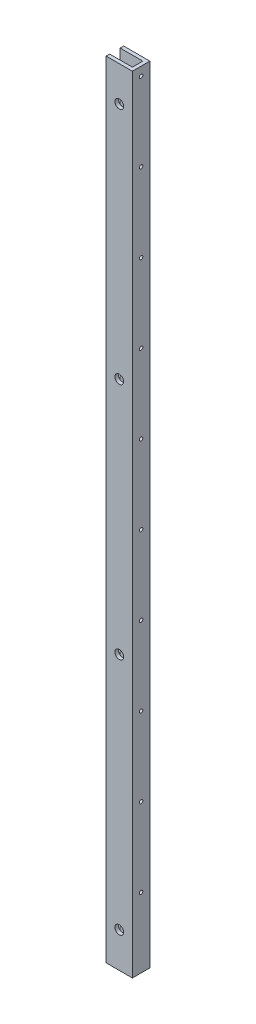
ISO-10303-21;
HEADER;
FILE_DESCRIPTION(('STEP AP214'),'2;1');
FILE_NAME('part.step','',(''),(''),'','','');
FILE_SCHEMA(('AUTOMOTIVE_DESIGN { 1 0 10303 214 1 1 1 1 }'));
ENDSEC;
DATA;
#1=APPLICATION_CONTEXT('core data for automotive mechanical design processes');
#2=APPLICATION_PROTOCOL_DEFINITION('international standard','automotive_design',2000,#1);
#3=PRODUCT_CONTEXT('',#1,'mechanical');
#4=PRODUCT('Part','Part','',(#3));
#5=PRODUCT_RELATED_PRODUCT_CATEGORY('part','',(#4));
#6=PRODUCT_DEFINITION_FORMATION('','',#4);
#7=PRODUCT_DEFINITION_CONTEXT('part definition',#1,'design');
#8=PRODUCT_DEFINITION('design','',#6,#7);
#9=PRODUCT_DEFINITION_SHAPE('','',#8);
#10=(LENGTH_UNIT() NAMED_UNIT(*) SI_UNIT(.MILLI.,.METRE.));
#11=(NAMED_UNIT(*) PLANE_ANGLE_UNIT() SI_UNIT($,.RADIAN.));
#12=(NAMED_UNIT(*) SI_UNIT($,.STERADIAN.) SOLID_ANGLE_UNIT());
#13=UNCERTAINTY_MEASURE_WITH_UNIT(LENGTH_MEASURE(1.E-05),#10,'distance_accuracy_value','');
#14=(GEOMETRIC_REPRESENTATION_CONTEXT(3) GLOBAL_UNCERTAINTY_ASSIGNED_CONTEXT((#13)) GLOBAL_UNIT_ASSIGNED_CONTEXT((#10,
#11,#12)) REPRESENTATION_CONTEXT('',''));
#15=CARTESIAN_POINT('',(0.,0.,0.));
#16=DIRECTION('',(0.,0.,1.));
#17=DIRECTION('',(1.,0.,0.));
#18=AXIS2_PLACEMENT_3D('',#15,#16,#17);
#19=CARTESIAN_POINT('',(0.,285.75,6.35));
#20=DIRECTION('',(-1.,0.,0.));
#21=DIRECTION('',(0.,0.,1.));
#22=AXIS2_PLACEMENT_3D('',#19,#20,#21);
#23=PLANE('',#22);
#24=CARTESIAN_POINT('',(0.,279.4,0.));
#25=DIRECTION('',(1.,0.,0.));
#26=DIRECTION('',(0.,0.,-1.));
#27=AXIS2_PLACEMENT_3D('',#24,#25,#26);
#28=CIRCLE('',#27,1.26999999999996);
#29=CARTESIAN_POINT('',(0.,279.4,-1.26999999999996));
#30=VERTEX_POINT('',#29);
#31=EDGE_CURVE('E165',#30,#30,#28,.T.);
#32=ORIENTED_EDGE('',*,*,#31,.F.);
#33=EDGE_LOOP('',(#32));
#34=FACE_BOUND('',#33,.T.);
#35=CARTESIAN_POINT('',(0.,222.25,-5.95115047316092E-13));
#36=DIRECTION('',(1.,0.,0.));
#37=DIRECTION('',(0.,0.,-1.));
#38=AXIS2_PLACEMENT_3D('',#35,#36,#37);
#39=CIRCLE('',#38,1.26999999999999);
#40=CARTESIAN_POINT('',(0.,222.25,-1.27000000000059));
#41=VERTEX_POINT('',#40);
#42=EDGE_CURVE('E231',#41,#41,#39,.T.);
#43=ORIENTED_EDGE('',*,*,#42,.F.);
#44=EDGE_LOOP('',(#43));
#45=FACE_BOUND('',#44,.T.);
#46=CARTESIAN_POINT('',(0.,165.1,-1.19023009463218E-12));
#47=DIRECTION('',(1.,0.,0.));
#48=DIRECTION('',(0.,0.,-1.));
#49=AXIS2_PLACEMENT_3D('',#46,#47,#48);
#50=CIRCLE('',#49,1.26999999999999);
#51=CARTESIAN_POINT('',(0.,165.1,-1.27000000000119));
#52=VERTEX_POINT('',#51);
#53=EDGE_CURVE('E234',#52,#52,#50,.T.);
#54=ORIENTED_EDGE('',*,*,#53,.F.);
#55=EDGE_LOOP('',(#54));
#56=FACE_BOUND('',#55,.T.);
#57=CARTESIAN_POINT('',(0.,107.95,-1.78534514194827E-12));
#58=DIRECTION('',(1.,0.,0.));
#59=DIRECTION('',(0.,0.,-1.));
#60=AXIS2_PLACEMENT_3D('',#57,#58,#59);
#61=CIRCLE('',#60,1.26999999999998);
#62=CARTESIAN_POINT('',(0.,107.95,-1.27000000000176));
#63=VERTEX_POINT('',#62);
#64=EDGE_CURVE('E237',#63,#63,#61,.T.);
#65=ORIENTED_EDGE('',*,*,#64,.F.);
#66=EDGE_LOOP('',(#65));
#67=FACE_BOUND('',#66,.T.);
#68=CARTESIAN_POINT('',(0.,50.8,-2.38046018926437E-12));
#69=DIRECTION('',(1.,0.,0.));
#70=DIRECTION('',(0.,0.,-1.));
#71=AXIS2_PLACEMENT_3D('',#68,#69,#70);
#72=CIRCLE('',#71,1.26999999999998);
#73=CARTESIAN_POINT('',(0.,50.8,-1.27000000000236));
#74=VERTEX_POINT('',#73);
#75=EDGE_CURVE('E240',#74,#74,#72,.T.);
#76=ORIENTED_EDGE('',*,*,#75,.F.);
#77=EDGE_LOOP('',(#76));
#78=FACE_BOUND('',#77,.T.);
#79=CARTESIAN_POINT('',(0.,-6.35000000000002,-2.97557523658046E-12));
#80=DIRECTION('',(1.,0.,0.));
#81=DIRECTION('',(0.,0.,-1.));
#82=AXIS2_PLACEMENT_3D('',#79,#80,#81);
#83=CIRCLE('',#82,1.26999999999998);
#84=CARTESIAN_POINT('',(0.,-6.35000000000002,-1.27000000000296));
#85=VERTEX_POINT('',#84);
#86=EDGE_CURVE('E243',#85,#85,#83,.T.);
#87=ORIENTED_EDGE('',*,*,#86,.F.);
#88=EDGE_LOOP('',(#87));
#89=FACE_BOUND('',#88,.T.);
#90=CARTESIAN_POINT('',(0.,-63.5,-3.57069028389655E-12));
#91=DIRECTION('',(1.,0.,0.));
#92=DIRECTION('',(0.,0.,-1.));
#93=AXIS2_PLACEMENT_3D('',#90,#91,#92);
#94=CIRCLE('',#93,1.26999999999998);
#95=CARTESIAN_POINT('',(0.,-63.5,-1.27000000000355));
#96=VERTEX_POINT('',#95);
#97=EDGE_CURVE('E246',#96,#96,#94,.T.);
#98=ORIENTED_EDGE('',*,*,#97,.F.);
#99=EDGE_LOOP('',(#98));
#100=FACE_BOUND('',#99,.T.);
#101=CARTESIAN_POINT('',(0.,-120.65,-4.16580533121264E-12));
#102=DIRECTION('',(1.,0.,0.));
#103=DIRECTION('',(0.,0.,-1.));
#104=AXIS2_PLACEMENT_3D('',#101,#102,#103);
#105=CIRCLE('',#104,1.26999999999998);
#106=CARTESIAN_POINT('',(0.,-120.65,-1.27000000000415));
#107=VERTEX_POINT('',#106);
#108=EDGE_CURVE('E249',#107,#107,#105,.T.);
#109=ORIENTED_EDGE('',*,*,#108,.F.);
#110=EDGE_LOOP('',(#109));
#111=FACE_BOUND('',#110,.T.);
#112=CARTESIAN_POINT('',(0.,-177.8,-4.76092037852873E-12));
#113=DIRECTION('',(1.,0.,0.));
#114=DIRECTION('',(0.,0.,-1.));
#115=AXIS2_PLACEMENT_3D('',#112,#113,#114);
#116=CIRCLE('',#115,1.27);
#117=CARTESIAN_POINT('',(0.,-177.8,-1.27000000000476));
#118=VERTEX_POINT('',#117);
#119=EDGE_CURVE('E252',#118,#118,#116,.T.);
#120=ORIENTED_EDGE('',*,*,#119,.F.);
#121=EDGE_LOOP('',(#120));
#122=FACE_BOUND('',#121,.T.);
#123=CARTESIAN_POINT('',(0.,-234.95,-5.35603542584482E-12));
#124=DIRECTION('',(1.,0.,0.));
#125=DIRECTION('',(0.,0.,-1.));
#126=AXIS2_PLACEMENT_3D('',#123,#124,#125);
#127=CIRCLE('',#126,1.27);
#128=CARTESIAN_POINT('',(0.,-234.95,-1.27000000000535));
#129=VERTEX_POINT('',#128);
#130=EDGE_CURVE('E204',#129,#129,#127,.T.);
#131=ORIENTED_EDGE('',*,*,#130,.F.);
#132=EDGE_LOOP('',(#131));
#133=FACE_BOUND('',#132,.T.);
#134=DIRECTION('',(0.,0.,-1.));
#135=VECTOR('',#134,1.);
#136=CARTESIAN_POINT('',(0.,-285.75,6.35));
#137=LINE('',#136,#135);
#138=CARTESIAN_POINT('',(0.,-285.75,6.35));
#139=VERTEX_POINT('',#138);
#140=CARTESIAN_POINT('',(0.,-285.75,-6.35));
#141=VERTEX_POINT('',#140);
#142=EDGE_CURVE('E134',#139,#141,#137,.T.);
#143=ORIENTED_EDGE('',*,*,#142,.T.);
#144=DIRECTION('',(0.,-1.,0.));
#145=VECTOR('',#144,1.);
#146=CARTESIAN_POINT('',(0.,285.75,-6.35));
#147=LINE('',#146,#145);
#148=CARTESIAN_POINT('',(0.,285.75,-6.35));
#149=VERTEX_POINT('',#148);
#150=EDGE_CURVE('E11',#149,#141,#147,.T.);
#151=ORIENTED_EDGE('',*,*,#150,.F.);
#152=DIRECTION('',(0.,0.,-1.));
#153=VECTOR('',#152,1.);
#154=CARTESIAN_POINT('',(0.,285.75,6.35));
#155=LINE('',#154,#153);
#156=CARTESIAN_POINT('',(0.,285.75,6.35));
#157=VERTEX_POINT('',#156);
#158=EDGE_CURVE('E149',#157,#149,#155,.T.);
#159=ORIENTED_EDGE('',*,*,#158,.F.);
#160=DIRECTION('',(0.,-1.,0.));
#161=VECTOR('',#160,1.);
#162=CARTESIAN_POINT('',(0.,285.75,6.35));
#163=LINE('',#162,#161);
#164=EDGE_CURVE('E130',#157,#139,#163,.T.);
#165=ORIENTED_EDGE('',*,*,#164,.T.);
#166=EDGE_LOOP('',(#143,#151,#159,#165));
#167=FACE_BOUND('',#166,.T.);
#168=ADVANCED_FACE('F36',(#34,#45,#56,#67,#78,#89,#100,#111,#122,#133,#167),#23,.F.);
#169=CARTESIAN_POINT('',(0.,285.75,-6.35));
#170=DIRECTION('',(0.,0.,1.));
#171=DIRECTION('',(1.,0.,0.));
#172=AXIS2_PLACEMENT_3D('',#169,#170,#171);
#173=PLANE('',#172);
#174=CARTESIAN_POINT('',(-9.525,260.35,-6.35));
#175=DIRECTION('',(0.,0.,-1.));
#176=DIRECTION('',(-1.,0.,0.));
#177=AXIS2_PLACEMENT_3D('',#174,#175,#176);
#178=CIRCLE('',#177,6.34999999999999);
#179=CARTESIAN_POINT('',(-15.875,260.35,-6.35));
#180=VERTEX_POINT('',#179);
#181=EDGE_CURVE('E209',#180,#180,#178,.T.);
#182=ORIENTED_EDGE('',*,*,#181,.F.);
#183=EDGE_LOOP('',(#182));
#184=FACE_BOUND('',#183,.T.);
#185=CARTESIAN_POINT('',(-9.52500000000181,86.7918,-6.35));
#186=DIRECTION('',(0.,0.,-1.));
#187=DIRECTION('',(-1.,0.,0.));
#188=AXIS2_PLACEMENT_3D('',#185,#186,#187);
#189=CIRCLE('',#188,6.34999999999999);
#190=CARTESIAN_POINT('',(-15.8750000000018,86.7918,-6.35));
#191=VERTEX_POINT('',#190);
#192=EDGE_CURVE('E619',#191,#191,#189,.T.);
#193=ORIENTED_EDGE('',*,*,#192,.F.);
#194=EDGE_LOOP('',(#193));
#195=FACE_BOUND('',#194,.T.);
#196=CARTESIAN_POINT('',(-9.52500000000362,-86.7664,-6.35));
#197=DIRECTION('',(0.,0.,-1.));
#198=DIRECTION('',(-1.,0.,0.));
#199=AXIS2_PLACEMENT_3D('',#196,#197,#198);
#200=CIRCLE('',#199,6.34999999999999);
#201=CARTESIAN_POINT('',(-15.8750000000036,-86.7664,-6.35));
#202=VERTEX_POINT('',#201);
#203=EDGE_CURVE('E616',#202,#202,#200,.T.);
#204=ORIENTED_EDGE('',*,*,#203,.F.);
#205=EDGE_LOOP('',(#204));
#206=FACE_BOUND('',#205,.T.);
#207=CARTESIAN_POINT('',(-9.52500000000543,-260.3246,-6.35));
#208=DIRECTION('',(0.,0.,-1.));
#209=DIRECTION('',(-1.,0.,0.));
#210=AXIS2_PLACEMENT_3D('',#207,#208,#209);
#211=CIRCLE('',#210,6.34999999999999);
#212=CARTESIAN_POINT('',(-15.8750000000054,-260.3246,-6.35));
#213=VERTEX_POINT('',#212);
#214=EDGE_CURVE('E613',#213,#213,#211,.T.);
#215=ORIENTED_EDGE('',*,*,#214,.F.);
#216=EDGE_LOOP('',(#215));
#217=FACE_BOUND('',#216,.T.);
#218=DIRECTION('',(-1.,0.,0.));
#219=VECTOR('',#218,1.);
#220=CARTESIAN_POINT('',(0.,-285.75,-6.35));
#221=LINE('',#220,#219);
#222=CARTESIAN_POINT('',(-19.05,-285.75,-6.35));
#223=VERTEX_POINT('',#222);
#224=EDGE_CURVE('E137',#141,#223,#221,.T.);
#225=ORIENTED_EDGE('',*,*,#224,.T.);
#226=DIRECTION('',(0.,-1.,0.));
#227=VECTOR('',#226,1.);
#228=CARTESIAN_POINT('',(-19.05,285.75,-6.35));
#229=LINE('',#228,#227);
#230=CARTESIAN_POINT('',(-19.05,285.75,-6.35));
#231=VERTEX_POINT('',#230);
#232=EDGE_CURVE('E45',#231,#223,#229,.T.);
#233=ORIENTED_EDGE('',*,*,#232,.F.);
#234=DIRECTION('',(-1.,0.,0.));
#235=VECTOR('',#234,1.);
#236=CARTESIAN_POINT('',(0.,285.75,-6.35));
#237=LINE('',#236,#235);
#238=EDGE_CURVE('E97',#149,#231,#237,.T.);
#239=ORIENTED_EDGE('',*,*,#238,.F.);
#240=ORIENTED_EDGE('',*,*,#150,.T.);
#241=EDGE_LOOP('',(#225,#233,#239,#240));
#242=FACE_BOUND('',#241,.T.);
#243=ADVANCED_FACE('F292',(#184,#195,#206,#217,#242),#173,.F.);
#244=CARTESIAN_POINT('',(-19.05,285.75,-3.81));
#245=DIRECTION('',(1.,0.,0.));
#246=DIRECTION('',(0.,0.,-1.));
#247=AXIS2_PLACEMENT_3D('',#244,#245,#246);
#248=PLANE('',#247);
#249=DIRECTION('',(0.,0.,1.));
#250=VECTOR('',#249,1.);
#251=CARTESIAN_POINT('',(-19.05,-285.75,-3.81));
#252=LINE('',#251,#250);
#253=CARTESIAN_POINT('',(-19.05,-285.75,-3.81));
#254=VERTEX_POINT('',#253);
#255=EDGE_CURVE('E140',#223,#254,#252,.T.);
#256=ORIENTED_EDGE('',*,*,#255,.T.);
#257=DIRECTION('',(0.,-1.,0.));
#258=VECTOR('',#257,1.);
#259=CARTESIAN_POINT('',(-19.05,285.75,-3.81));
#260=LINE('',#259,#258);
#261=CARTESIAN_POINT('',(-19.05,285.75,-3.81));
#262=VERTEX_POINT('',#261);
#263=EDGE_CURVE('E156',#262,#254,#260,.T.);
#264=ORIENTED_EDGE('',*,*,#263,.F.);
#265=DIRECTION('',(0.,0.,1.));
#266=VECTOR('',#265,1.);
#267=CARTESIAN_POINT('',(-19.05,285.75,-3.81));
#268=LINE('',#267,#266);
#269=EDGE_CURVE('E259',#231,#262,#268,.T.);
#270=ORIENTED_EDGE('',*,*,#269,.F.);
#271=ORIENTED_EDGE('',*,*,#232,.T.);
#272=EDGE_LOOP('',(#256,#264,#270,#271));
#273=FACE_BOUND('',#272,.T.);
#274=ADVANCED_FACE('F297',(#273),#248,.F.);
#275=CARTESIAN_POINT('',(-2.54,285.75,-3.81));
#276=DIRECTION('',(0.,0.,-1.));
#277=DIRECTION('',(-1.,0.,0.));
#278=AXIS2_PLACEMENT_3D('',#275,#276,#277);
#279=PLANE('',#278);
#280=CARTESIAN_POINT('',(-9.525,260.35,-3.81));
#281=DIRECTION('',(0.,0.,-1.));
#282=DIRECTION('',(-1.,0.,0.));
#283=AXIS2_PLACEMENT_3D('',#280,#281,#282);
#284=CIRCLE('',#283,6.34999999999999);
#285=CARTESIAN_POINT('',(-15.875,260.35,-3.81));
#286=VERTEX_POINT('',#285);
#287=EDGE_CURVE('E39',#286,#286,#284,.T.);
#288=ORIENTED_EDGE('',*,*,#287,.T.);
#289=EDGE_LOOP('',(#288));
#290=FACE_BOUND('',#289,.T.);
#291=CARTESIAN_POINT('',(-9.52500000000181,86.7918,-3.81));
#292=DIRECTION('',(0.,0.,-1.));
#293=DIRECTION('',(-1.,0.,0.));
#294=AXIS2_PLACEMENT_3D('',#291,#292,#293);
#295=CIRCLE('',#294,6.34999999999999);
#296=CARTESIAN_POINT('',(-15.8750000000018,86.7918,-3.81));
#297=VERTEX_POINT('',#296);
#298=EDGE_CURVE('E211',#297,#297,#295,.T.);
#299=ORIENTED_EDGE('',*,*,#298,.T.);
#300=EDGE_LOOP('',(#299));
#301=FACE_BOUND('',#300,.T.);
#302=CARTESIAN_POINT('',(-9.52500000000362,-86.7664,-3.81));
#303=DIRECTION('',(0.,0.,-1.));
#304=DIRECTION('',(-1.,0.,0.));
#305=AXIS2_PLACEMENT_3D('',#302,#303,#304);
#306=CIRCLE('',#305,6.34999999999999);
#307=CARTESIAN_POINT('',(-15.8750000000036,-86.7664,-3.81));
#308=VERTEX_POINT('',#307);
#309=EDGE_CURVE('E208',#308,#308,#306,.T.);
#310=ORIENTED_EDGE('',*,*,#309,.T.);
#311=EDGE_LOOP('',(#310));
#312=FACE_BOUND('',#311,.T.);
#313=CARTESIAN_POINT('',(-9.52500000000543,-260.3246,-3.81));
#314=DIRECTION('',(0.,0.,-1.));
#315=DIRECTION('',(-1.,0.,0.));
#316=AXIS2_PLACEMENT_3D('',#313,#314,#315);
#317=CIRCLE('',#316,6.34999999999999);
#318=CARTESIAN_POINT('',(-15.8750000000054,-260.3246,-3.81));
#319=VERTEX_POINT('',#318);
#320=EDGE_CURVE('E205',#319,#319,#317,.T.);
#321=ORIENTED_EDGE('',*,*,#320,.T.);
#322=EDGE_LOOP('',(#321));
#323=FACE_BOUND('',#322,.T.);
#324=DIRECTION('',(1.,0.,0.));
#325=VECTOR('',#324,1.);
#326=CARTESIAN_POINT('',(-2.54,-285.75,-3.81));
#327=LINE('',#326,#325);
#328=CARTESIAN_POINT('',(-2.54,-285.75,-3.81));
#329=VERTEX_POINT('',#328);
#330=EDGE_CURVE('E142',#254,#329,#327,.T.);
#331=ORIENTED_EDGE('',*,*,#330,.T.);
#332=DIRECTION('',(0.,-1.,0.));
#333=VECTOR('',#332,1.);
#334=CARTESIAN_POINT('',(-2.54,285.75,-3.81));
#335=LINE('',#334,#333);
#336=CARTESIAN_POINT('',(-2.54,285.75,-3.81));
#337=VERTEX_POINT('',#336);
#338=EDGE_CURVE('E153',#337,#329,#335,.T.);
#339=ORIENTED_EDGE('',*,*,#338,.F.);
#340=DIRECTION('',(1.,0.,0.));
#341=VECTOR('',#340,1.);
#342=CARTESIAN_POINT('',(-2.54,285.75,-3.81));
#343=LINE('',#342,#341);
#344=EDGE_CURVE('E261',#262,#337,#343,.T.);
#345=ORIENTED_EDGE('',*,*,#344,.F.);
#346=ORIENTED_EDGE('',*,*,#263,.T.);
#347=EDGE_LOOP('',(#331,#339,#345,#346));
#348=FACE_BOUND('',#347,.T.);
#349=ADVANCED_FACE('F267',(#290,#301,#312,#323,#348),#279,.F.);
#350=CARTESIAN_POINT('',(-2.54,285.75,3.81));
#351=DIRECTION('',(1.,0.,0.));
#352=DIRECTION('',(0.,0.,-1.));
#353=AXIS2_PLACEMENT_3D('',#350,#351,#352);
#354=PLANE('',#353);
#355=CARTESIAN_POINT('',(-2.54,279.4,0.));
#356=DIRECTION('',(1.,0.,0.));
#357=DIRECTION('',(0.,0.,-1.));
#358=AXIS2_PLACEMENT_3D('',#355,#356,#357);
#359=CIRCLE('',#358,1.26999999999996);
#360=CARTESIAN_POINT('',(-2.54,279.4,-1.26999999999996));
#361=VERTEX_POINT('',#360);
#362=EDGE_CURVE('E138',#361,#361,#359,.T.);
#363=ORIENTED_EDGE('',*,*,#362,.T.);
#364=EDGE_LOOP('',(#363));
#365=FACE_BOUND('',#364,.T.);
#366=CARTESIAN_POINT('',(-2.54,222.25,-5.95115047316092E-13));
#367=DIRECTION('',(1.,0.,0.));
#368=DIRECTION('',(0.,0.,-1.));
#369=AXIS2_PLACEMENT_3D('',#366,#367,#368);
#370=CIRCLE('',#369,1.26999999999999);
#371=CARTESIAN_POINT('',(-2.54,222.25,-1.27000000000059));
#372=VERTEX_POINT('',#371);
#373=EDGE_CURVE('E186',#372,#372,#370,.T.);
#374=ORIENTED_EDGE('',*,*,#373,.T.);
#375=EDGE_LOOP('',(#374));
#376=FACE_BOUND('',#375,.T.);
#377=CARTESIAN_POINT('',(-2.54,165.1,-1.19023009463218E-12));
#378=DIRECTION('',(1.,0.,0.));
#379=DIRECTION('',(0.,0.,-1.));
#380=AXIS2_PLACEMENT_3D('',#377,#378,#379);
#381=CIRCLE('',#380,1.26999999999999);
#382=CARTESIAN_POINT('',(-2.54,165.1,-1.27000000000119));
#383=VERTEX_POINT('',#382);
#384=EDGE_CURVE('E183',#383,#383,#381,.T.);
#385=ORIENTED_EDGE('',*,*,#384,.T.);
#386=EDGE_LOOP('',(#385));
#387=FACE_BOUND('',#386,.T.);
#388=CARTESIAN_POINT('',(-2.54,107.95,-1.78534514194827E-12));
#389=DIRECTION('',(1.,0.,0.));
#390=DIRECTION('',(0.,0.,-1.));
#391=AXIS2_PLACEMENT_3D('',#388,#389,#390);
#392=CIRCLE('',#391,1.26999999999998);
#393=CARTESIAN_POINT('',(-2.54,107.95,-1.27000000000176));
#394=VERTEX_POINT('',#393);
#395=EDGE_CURVE('E180',#394,#394,#392,.T.);
#396=ORIENTED_EDGE('',*,*,#395,.T.);
#397=EDGE_LOOP('',(#396));
#398=FACE_BOUND('',#397,.T.);
#399=CARTESIAN_POINT('',(-2.54,50.8,-2.38046018926437E-12));
#400=DIRECTION('',(1.,0.,0.));
#401=DIRECTION('',(0.,0.,-1.));
#402=AXIS2_PLACEMENT_3D('',#399,#400,#401);
#403=CIRCLE('',#402,1.26999999999998);
#404=CARTESIAN_POINT('',(-2.54,50.8,-1.27000000000236));
#405=VERTEX_POINT('',#404);
#406=EDGE_CURVE('E177',#405,#405,#403,.T.);
#407=ORIENTED_EDGE('',*,*,#406,.T.);
#408=EDGE_LOOP('',(#407));
#409=FACE_BOUND('',#408,.T.);
#410=CARTESIAN_POINT('',(-2.54,-6.35000000000002,-2.97557523658046E-12));
#411=DIRECTION('',(1.,0.,0.));
#412=DIRECTION('',(0.,0.,-1.));
#413=AXIS2_PLACEMENT_3D('',#410,#411,#412);
#414=CIRCLE('',#413,1.26999999999998);
#415=CARTESIAN_POINT('',(-2.54,-6.35000000000002,-1.27000000000296));
#416=VERTEX_POINT('',#415);
#417=EDGE_CURVE('E174',#416,#416,#414,.T.);
#418=ORIENTED_EDGE('',*,*,#417,.T.);
#419=EDGE_LOOP('',(#418));
#420=FACE_BOUND('',#419,.T.);
#421=CARTESIAN_POINT('',(-2.54,-63.5,-3.57069028389655E-12));
#422=DIRECTION('',(1.,0.,0.));
#423=DIRECTION('',(0.,0.,-1.));
#424=AXIS2_PLACEMENT_3D('',#421,#422,#423);
#425=CIRCLE('',#424,1.26999999999998);
#426=CARTESIAN_POINT('',(-2.54,-63.5,-1.27000000000355));
#427=VERTEX_POINT('',#426);
#428=EDGE_CURVE('E171',#427,#427,#425,.T.);
#429=ORIENTED_EDGE('',*,*,#428,.T.);
#430=EDGE_LOOP('',(#429));
#431=FACE_BOUND('',#430,.T.);
#432=CARTESIAN_POINT('',(-2.54,-120.65,-4.16580533121264E-12));
#433=DIRECTION('',(1.,0.,0.));
#434=DIRECTION('',(0.,0.,-1.));
#435=AXIS2_PLACEMENT_3D('',#432,#433,#434);
#436=CIRCLE('',#435,1.26999999999998);
#437=CARTESIAN_POINT('',(-2.54,-120.65,-1.27000000000415));
#438=VERTEX_POINT('',#437);
#439=EDGE_CURVE('E168',#438,#438,#436,.T.);
#440=ORIENTED_EDGE('',*,*,#439,.T.);
#441=EDGE_LOOP('',(#440));
#442=FACE_BOUND('',#441,.T.);
#443=CARTESIAN_POINT('',(-2.54,-177.8,-4.76092037852873E-12));
#444=DIRECTION('',(1.,0.,0.));
#445=DIRECTION('',(0.,0.,-1.));
#446=AXIS2_PLACEMENT_3D('',#443,#444,#445);
#447=CIRCLE('',#446,1.27);
#448=CARTESIAN_POINT('',(-2.54,-177.8,-1.27000000000476));
#449=VERTEX_POINT('',#448);
#450=EDGE_CURVE('E164',#449,#449,#447,.T.);
#451=ORIENTED_EDGE('',*,*,#450,.T.);
#452=EDGE_LOOP('',(#451));
#453=FACE_BOUND('',#452,.T.);
#454=CARTESIAN_POINT('',(-2.54,-234.95,-5.35603542584482E-12));
#455=DIRECTION('',(1.,0.,0.));
#456=DIRECTION('',(0.,0.,-1.));
#457=AXIS2_PLACEMENT_3D('',#454,#455,#456);
#458=CIRCLE('',#457,1.27);
#459=CARTESIAN_POINT('',(-2.54,-234.95,-1.27000000000535));
#460=VERTEX_POINT('',#459);
#461=EDGE_CURVE('E161',#460,#460,#458,.T.);
#462=ORIENTED_EDGE('',*,*,#461,.T.);
#463=EDGE_LOOP('',(#462));
#464=FACE_BOUND('',#463,.T.);
#465=DIRECTION('',(0.,0.,1.));
#466=VECTOR('',#465,1.);
#467=CARTESIAN_POINT('',(-2.54,-285.75,3.81));
#468=LINE('',#467,#466);
#469=CARTESIAN_POINT('',(-2.54,-285.75,3.81));
#470=VERTEX_POINT('',#469);
#471=EDGE_CURVE('E144',#329,#470,#468,.T.);
#472=ORIENTED_EDGE('',*,*,#471,.T.);
#473=DIRECTION('',(0.,-1.,0.));
#474=VECTOR('',#473,1.);
#475=CARTESIAN_POINT('',(-2.54,285.75,3.81));
#476=LINE('',#475,#474);
#477=CARTESIAN_POINT('',(-2.54,285.75,3.81));
#478=VERTEX_POINT('',#477);
#479=EDGE_CURVE('E125',#478,#470,#476,.T.);
#480=ORIENTED_EDGE('',*,*,#479,.F.);
#481=DIRECTION('',(0.,0.,1.));
#482=VECTOR('',#481,1.);
#483=CARTESIAN_POINT('',(-2.54,285.75,3.81));
#484=LINE('',#483,#482);
#485=EDGE_CURVE('E116',#337,#478,#484,.T.);
#486=ORIENTED_EDGE('',*,*,#485,.F.);
#487=ORIENTED_EDGE('',*,*,#338,.T.);
#488=EDGE_LOOP('',(#472,#480,#486,#487));
#489=FACE_BOUND('',#488,.T.);
#490=ADVANCED_FACE('F271',(#365,#376,#387,#398,#409,#420,#431,#442,#453,#464,#489),#354,.F.);
#491=CARTESIAN_POINT('',(-2.54,285.75,3.81));
#492=DIRECTION('',(0.,0.,1.));
#493=DIRECTION('',(1.,0.,0.));
#494=AXIS2_PLACEMENT_3D('',#491,#492,#493);
#495=PLANE('',#494);
#496=CARTESIAN_POINT('',(-9.525,260.35,3.81));
#497=DIRECTION('',(0.,0.,-1.));
#498=DIRECTION('',(-1.,0.,0.));
#499=AXIS2_PLACEMENT_3D('',#496,#497,#498);
#500=CIRCLE('',#499,3.175);
#501=CARTESIAN_POINT('',(-12.7,260.35,3.81));
#502=VERTEX_POINT('',#501);
#503=EDGE_CURVE('E195',#502,#502,#500,.T.);
#504=ORIENTED_EDGE('',*,*,#503,.F.);
#505=EDGE_LOOP('',(#504));
#506=FACE_BOUND('',#505,.T.);
#507=CARTESIAN_POINT('',(-9.52500000000181,86.868,3.81));
#508=DIRECTION('',(0.,0.,-1.));
#509=DIRECTION('',(-1.,0.,0.));
#510=AXIS2_PLACEMENT_3D('',#507,#508,#509);
#511=CIRCLE('',#510,3.175);
#512=CARTESIAN_POINT('',(-12.7000000000018,86.868,3.81));
#513=VERTEX_POINT('',#512);
#514=EDGE_CURVE('E225',#513,#513,#511,.T.);
#515=ORIENTED_EDGE('',*,*,#514,.F.);
#516=EDGE_LOOP('',(#515));
#517=FACE_BOUND('',#516,.T.);
#518=CARTESIAN_POINT('',(-9.52500000000361,-86.614,3.81));
#519=DIRECTION('',(0.,0.,-1.));
#520=DIRECTION('',(-1.,0.,0.));
#521=AXIS2_PLACEMENT_3D('',#518,#519,#520);
#522=CIRCLE('',#521,3.175);
#523=CARTESIAN_POINT('',(-12.7000000000036,-86.614,3.81));
#524=VERTEX_POINT('',#523);
#525=EDGE_CURVE('E220',#524,#524,#522,.T.);
#526=ORIENTED_EDGE('',*,*,#525,.F.);
#527=EDGE_LOOP('',(#526));
#528=FACE_BOUND('',#527,.T.);
#529=CARTESIAN_POINT('',(-9.52500000000542,-260.096,3.81));
#530=DIRECTION('',(0.,0.,-1.));
#531=DIRECTION('',(-1.,0.,0.));
#532=AXIS2_PLACEMENT_3D('',#529,#530,#531);
#533=CIRCLE('',#532,3.175);
#534=CARTESIAN_POINT('',(-12.7000000000054,-260.096,3.81));
#535=VERTEX_POINT('',#534);
#536=EDGE_CURVE('E216',#535,#535,#533,.T.);
#537=ORIENTED_EDGE('',*,*,#536,.F.);
#538=EDGE_LOOP('',(#537));
#539=FACE_BOUND('',#538,.T.);
#540=DIRECTION('',(-1.,0.,0.));
#541=VECTOR('',#540,1.);
#542=CARTESIAN_POINT('',(-2.54,-285.75,3.81));
#543=LINE('',#542,#541);
#544=CARTESIAN_POINT('',(-19.05,-285.75,3.81));
#545=VERTEX_POINT('',#544);
#546=EDGE_CURVE('E124',#470,#545,#543,.T.);
#547=ORIENTED_EDGE('',*,*,#546,.T.);
#548=DIRECTION('',(0.,-1.,0.));
#549=VECTOR('',#548,1.);
#550=CARTESIAN_POINT('',(-19.05,285.75,3.81));
#551=LINE('',#550,#549);
#552=CARTESIAN_POINT('',(-19.05,285.75,3.81));
#553=VERTEX_POINT('',#552);
#554=EDGE_CURVE('E121',#553,#545,#551,.T.);
#555=ORIENTED_EDGE('',*,*,#554,.F.);
#556=DIRECTION('',(-1.,0.,0.));
#557=VECTOR('',#556,1.);
#558=CARTESIAN_POINT('',(-2.54,285.75,3.81));
#559=LINE('',#558,#557);
#560=EDGE_CURVE('E110',#478,#553,#559,.T.);
#561=ORIENTED_EDGE('',*,*,#560,.F.);
#562=ORIENTED_EDGE('',*,*,#479,.T.);
#563=EDGE_LOOP('',(#547,#555,#561,#562));
#564=FACE_BOUND('',#563,.T.);
#565=ADVANCED_FACE('F122',(#506,#517,#528,#539,#564),#495,.F.);
#566=CARTESIAN_POINT('',(-19.05,285.75,3.81));
#567=DIRECTION('',(1.,0.,0.));
#568=DIRECTION('',(0.,0.,-1.));
#569=AXIS2_PLACEMENT_3D('',#566,#567,#568);
#570=PLANE('',#569);
#571=DIRECTION('',(0.,0.,1.));
#572=VECTOR('',#571,1.);
#573=CARTESIAN_POINT('',(-19.05,-285.75,3.81));
#574=LINE('',#573,#572);
#575=CARTESIAN_POINT('',(-19.05,-285.75,6.35));
#576=VERTEX_POINT('',#575);
#577=EDGE_CURVE('E83',#545,#576,#574,.T.);
#578=ORIENTED_EDGE('',*,*,#577,.T.);
#579=DIRECTION('',(0.,-1.,0.));
#580=VECTOR('',#579,1.);
#581=CARTESIAN_POINT('',(-19.05,285.75,6.35));
#582=LINE('',#581,#580);
#583=CARTESIAN_POINT('',(-19.05,285.75,6.35));
#584=VERTEX_POINT('',#583);
#585=EDGE_CURVE('E126',#584,#576,#582,.T.);
#586=ORIENTED_EDGE('',*,*,#585,.F.);
#587=DIRECTION('',(0.,0.,1.));
#588=VECTOR('',#587,1.);
#589=CARTESIAN_POINT('',(-19.05,285.75,3.81));
#590=LINE('',#589,#588);
#591=EDGE_CURVE('E114',#553,#584,#590,.T.);
#592=ORIENTED_EDGE('',*,*,#591,.F.);
#593=ORIENTED_EDGE('',*,*,#554,.T.);
#594=EDGE_LOOP('',(#578,#586,#592,#593));
#595=FACE_BOUND('',#594,.T.);
#596=ADVANCED_FACE('F128',(#595),#570,.F.);
#597=CARTESIAN_POINT('',(0.,285.75,6.35));
#598=DIRECTION('',(0.,0.,-1.));
#599=DIRECTION('',(-1.,0.,0.));
#600=AXIS2_PLACEMENT_3D('',#597,#598,#599);
#601=PLANE('',#600);
#602=CARTESIAN_POINT('',(-9.525,260.35,6.34999999999999));
#603=DIRECTION('',(0.,0.,-1.));
#604=DIRECTION('',(-1.,0.,0.));
#605=AXIS2_PLACEMENT_3D('',#602,#603,#604);
#606=CIRCLE('',#605,3.175);
#607=CARTESIAN_POINT('',(-12.7,260.35,6.34999999999999));
#608=VERTEX_POINT('',#607);
#609=EDGE_CURVE('E201',#608,#608,#606,.T.);
#610=ORIENTED_EDGE('',*,*,#609,.T.);
#611=EDGE_LOOP('',(#610));
#612=FACE_BOUND('',#611,.T.);
#613=CARTESIAN_POINT('',(-9.52500000000181,86.868,6.34999999999999));
#614=DIRECTION('',(0.,0.,-1.));
#615=DIRECTION('',(-1.,0.,0.));
#616=AXIS2_PLACEMENT_3D('',#613,#614,#615);
#617=CIRCLE('',#616,3.175);
#618=CARTESIAN_POINT('',(-12.7000000000018,86.868,6.34999999999999));
#619=VERTEX_POINT('',#618);
#620=EDGE_CURVE('E198',#619,#619,#617,.T.);
#621=ORIENTED_EDGE('',*,*,#620,.T.);
#622=EDGE_LOOP('',(#621));
#623=FACE_BOUND('',#622,.T.);
#624=CARTESIAN_POINT('',(-9.52500000000361,-86.614,6.34999999999999));
#625=DIRECTION('',(0.,0.,-1.));
#626=DIRECTION('',(-1.,0.,0.));
#627=AXIS2_PLACEMENT_3D('',#624,#625,#626);
#628=CIRCLE('',#627,3.175);
#629=CARTESIAN_POINT('',(-12.7000000000036,-86.614,6.34999999999999));
#630=VERTEX_POINT('',#629);
#631=EDGE_CURVE('E194',#630,#630,#628,.T.);
#632=ORIENTED_EDGE('',*,*,#631,.T.);
#633=EDGE_LOOP('',(#632));
#634=FACE_BOUND('',#633,.T.);
#635=CARTESIAN_POINT('',(-9.52500000000542,-260.096,6.34999999999999));
#636=DIRECTION('',(0.,0.,-1.));
#637=DIRECTION('',(-1.,0.,0.));
#638=AXIS2_PLACEMENT_3D('',#635,#636,#637);
#639=CIRCLE('',#638,3.175);
#640=CARTESIAN_POINT('',(-12.7000000000054,-260.096,6.34999999999999));
#641=VERTEX_POINT('',#640);
#642=EDGE_CURVE('E191',#641,#641,#639,.T.);
#643=ORIENTED_EDGE('',*,*,#642,.T.);
#644=EDGE_LOOP('',(#643));
#645=FACE_BOUND('',#644,.T.);
#646=DIRECTION('',(1.,0.,0.));
#647=VECTOR('',#646,1.);
#648=CARTESIAN_POINT('',(0.,-285.75,6.35));
#649=LINE('',#648,#647);
#650=EDGE_CURVE('E89',#576,#139,#649,.T.);
#651=ORIENTED_EDGE('',*,*,#650,.T.);
#652=ORIENTED_EDGE('',*,*,#164,.F.);
#653=DIRECTION('',(1.,0.,0.));
#654=VECTOR('',#653,1.);
#655=CARTESIAN_POINT('',(0.,285.75,6.35));
#656=LINE('',#655,#654);
#657=EDGE_CURVE('E54',#584,#157,#656,.T.);
#658=ORIENTED_EDGE('',*,*,#657,.F.);
#659=ORIENTED_EDGE('',*,*,#585,.T.);
#660=EDGE_LOOP('',(#651,#652,#658,#659));
#661=FACE_BOUND('',#660,.T.);
#662=ADVANCED_FACE('F279',(#612,#623,#634,#645,#661),#601,.F.);
#663=CARTESIAN_POINT('',(0.,285.75,0.));
#664=DIRECTION('',(0.,1.,0.));
#665=DIRECTION('',(0.,0.,1.));
#666=AXIS2_PLACEMENT_3D('',#663,#664,#665);
#667=PLANE('',#666);
#668=ORIENTED_EDGE('',*,*,#158,.T.);
#669=ORIENTED_EDGE('',*,*,#238,.T.);
#670=ORIENTED_EDGE('',*,*,#269,.T.);
#671=ORIENTED_EDGE('',*,*,#344,.T.);
#672=ORIENTED_EDGE('',*,*,#485,.T.);
#673=ORIENTED_EDGE('',*,*,#560,.T.);
#674=ORIENTED_EDGE('',*,*,#591,.T.);
#675=ORIENTED_EDGE('',*,*,#657,.T.);
#676=EDGE_LOOP('',(#668,#669,#670,#671,#672,#673,#674,#675));
#677=FACE_BOUND('',#676,.T.);
#678=ADVANCED_FACE('F112',(#677),#667,.T.);
#679=CARTESIAN_POINT('',(0.,-285.75,0.));
#680=DIRECTION('',(0.,1.,0.));
#681=DIRECTION('',(0.,0.,1.));
#682=AXIS2_PLACEMENT_3D('',#679,#680,#681);
#683=PLANE('',#682);
#684=ORIENTED_EDGE('',*,*,#142,.F.);
#685=ORIENTED_EDGE('',*,*,#650,.F.);
#686=ORIENTED_EDGE('',*,*,#577,.F.);
#687=ORIENTED_EDGE('',*,*,#546,.F.);
#688=ORIENTED_EDGE('',*,*,#471,.F.);
#689=ORIENTED_EDGE('',*,*,#330,.F.);
#690=ORIENTED_EDGE('',*,*,#255,.F.);
#691=ORIENTED_EDGE('',*,*,#224,.F.);
#692=EDGE_LOOP('',(#684,#685,#686,#687,#688,#689,#690,#691));
#693=FACE_BOUND('',#692,.T.);
#694=ADVANCED_FACE('F274',(#693),#683,.F.);
#695=CARTESIAN_POINT('',(-19.05,-234.95,-5.35603542584482E-12));
#696=DIRECTION('',(1.,0.,0.));
#697=DIRECTION('',(0.,0.,-1.));
#698=AXIS2_PLACEMENT_3D('',#695,#696,#697);
#699=CYLINDRICAL_SURFACE('',#698,1.27);
#700=ORIENTED_EDGE('',*,*,#130,.T.);
#701=EDGE_LOOP('',(#700));
#702=FACE_BOUND('',#701,.T.);
#703=ORIENTED_EDGE('',*,*,#461,.F.);
#704=EDGE_LOOP('',(#703));
#705=FACE_BOUND('',#704,.T.);
#706=ADVANCED_FACE('F319',(#702,#705),#699,.F.);
#707=CARTESIAN_POINT('',(-19.05,-177.8,-4.76092037852873E-12));
#708=DIRECTION('',(1.,0.,0.));
#709=DIRECTION('',(0.,0.,-1.));
#710=AXIS2_PLACEMENT_3D('',#707,#708,#709);
#711=CYLINDRICAL_SURFACE('',#710,1.27);
#712=ORIENTED_EDGE('',*,*,#119,.T.);
#713=EDGE_LOOP('',(#712));
#714=FACE_BOUND('',#713,.T.);
#715=ORIENTED_EDGE('',*,*,#450,.F.);
#716=EDGE_LOOP('',(#715));
#717=FACE_BOUND('',#716,.T.);
#718=ADVANCED_FACE('F322',(#714,#717),#711,.F.);
#719=CARTESIAN_POINT('',(-19.05,-120.65,-4.16580533121264E-12));
#720=DIRECTION('',(1.,0.,0.));
#721=DIRECTION('',(0.,0.,-1.));
#722=AXIS2_PLACEMENT_3D('',#719,#720,#721);
#723=CYLINDRICAL_SURFACE('',#722,1.26999999999998);
#724=ORIENTED_EDGE('',*,*,#108,.T.);
#725=EDGE_LOOP('',(#724));
#726=FACE_BOUND('',#725,.T.);
#727=ORIENTED_EDGE('',*,*,#439,.F.);
#728=EDGE_LOOP('',(#727));
#729=FACE_BOUND('',#728,.T.);
#730=ADVANCED_FACE('F443',(#726,#729),#723,.F.);
#731=CARTESIAN_POINT('',(-19.05,-63.5,-3.57069028389655E-12));
#732=DIRECTION('',(1.,0.,0.));
#733=DIRECTION('',(0.,0.,-1.));
#734=AXIS2_PLACEMENT_3D('',#731,#732,#733);
#735=CYLINDRICAL_SURFACE('',#734,1.26999999999998);
#736=ORIENTED_EDGE('',*,*,#97,.T.);
#737=EDGE_LOOP('',(#736));
#738=FACE_BOUND('',#737,.T.);
#739=ORIENTED_EDGE('',*,*,#428,.F.);
#740=EDGE_LOOP('',(#739));
#741=FACE_BOUND('',#740,.T.);
#742=ADVANCED_FACE('F439',(#738,#741),#735,.F.);
#743=CARTESIAN_POINT('',(-19.05,-6.35000000000002,-2.97557523658046E-12));
#744=DIRECTION('',(1.,0.,0.));
#745=DIRECTION('',(0.,0.,-1.));
#746=AXIS2_PLACEMENT_3D('',#743,#744,#745);
#747=CYLINDRICAL_SURFACE('',#746,1.26999999999998);
#748=ORIENTED_EDGE('',*,*,#86,.T.);
#749=EDGE_LOOP('',(#748));
#750=FACE_BOUND('',#749,.T.);
#751=ORIENTED_EDGE('',*,*,#417,.F.);
#752=EDGE_LOOP('',(#751));
#753=FACE_BOUND('',#752,.T.);
#754=ADVANCED_FACE('F435',(#750,#753),#747,.F.);
#755=CARTESIAN_POINT('',(-19.05,50.8,-2.38046018926437E-12));
#756=DIRECTION('',(1.,0.,0.));
#757=DIRECTION('',(0.,0.,-1.));
#758=AXIS2_PLACEMENT_3D('',#755,#756,#757);
#759=CYLINDRICAL_SURFACE('',#758,1.26999999999998);
#760=ORIENTED_EDGE('',*,*,#75,.T.);
#761=EDGE_LOOP('',(#760));
#762=FACE_BOUND('',#761,.T.);
#763=ORIENTED_EDGE('',*,*,#406,.F.);
#764=EDGE_LOOP('',(#763));
#765=FACE_BOUND('',#764,.T.);
#766=ADVANCED_FACE('F431',(#762,#765),#759,.F.);
#767=CARTESIAN_POINT('',(-19.05,107.95,-1.78534514194827E-12));
#768=DIRECTION('',(1.,0.,0.));
#769=DIRECTION('',(0.,0.,-1.));
#770=AXIS2_PLACEMENT_3D('',#767,#768,#769);
#771=CYLINDRICAL_SURFACE('',#770,1.26999999999998);
#772=ORIENTED_EDGE('',*,*,#64,.T.);
#773=EDGE_LOOP('',(#772));
#774=FACE_BOUND('',#773,.T.);
#775=ORIENTED_EDGE('',*,*,#395,.F.);
#776=EDGE_LOOP('',(#775));
#777=FACE_BOUND('',#776,.T.);
#778=ADVANCED_FACE('F427',(#774,#777),#771,.F.);
#779=CARTESIAN_POINT('',(-19.05,165.1,-1.19023009463218E-12));
#780=DIRECTION('',(1.,0.,0.));
#781=DIRECTION('',(0.,0.,-1.));
#782=AXIS2_PLACEMENT_3D('',#779,#780,#781);
#783=CYLINDRICAL_SURFACE('',#782,1.26999999999999);
#784=ORIENTED_EDGE('',*,*,#53,.T.);
#785=EDGE_LOOP('',(#784));
#786=FACE_BOUND('',#785,.T.);
#787=ORIENTED_EDGE('',*,*,#384,.F.);
#788=EDGE_LOOP('',(#787));
#789=FACE_BOUND('',#788,.T.);
#790=ADVANCED_FACE('F423',(#786,#789),#783,.F.);
#791=CARTESIAN_POINT('',(-19.05,222.25,-5.95115047316092E-13));
#792=DIRECTION('',(1.,0.,0.));
#793=DIRECTION('',(0.,0.,-1.));
#794=AXIS2_PLACEMENT_3D('',#791,#792,#793);
#795=CYLINDRICAL_SURFACE('',#794,1.26999999999999);
#796=ORIENTED_EDGE('',*,*,#42,.T.);
#797=EDGE_LOOP('',(#796));
#798=FACE_BOUND('',#797,.T.);
#799=ORIENTED_EDGE('',*,*,#373,.F.);
#800=EDGE_LOOP('',(#799));
#801=FACE_BOUND('',#800,.T.);
#802=ADVANCED_FACE('F419',(#798,#801),#795,.F.);
#803=CARTESIAN_POINT('',(-19.05,279.4,0.));
#804=DIRECTION('',(1.,0.,0.));
#805=DIRECTION('',(0.,0.,-1.));
#806=AXIS2_PLACEMENT_3D('',#803,#804,#805);
#807=CYLINDRICAL_SURFACE('',#806,1.26999999999996);
#808=ORIENTED_EDGE('',*,*,#31,.T.);
#809=EDGE_LOOP('',(#808));
#810=FACE_BOUND('',#809,.T.);
#811=ORIENTED_EDGE('',*,*,#362,.F.);
#812=EDGE_LOOP('',(#811));
#813=FACE_BOUND('',#812,.T.);
#814=ADVANCED_FACE('F416',(#810,#813),#807,.F.);
#815=CARTESIAN_POINT('',(-9.5250000000054,-260.096,144.018));
#816=DIRECTION('',(0.,0.,-1.));
#817=DIRECTION('',(-1.,0.,0.));
#818=AXIS2_PLACEMENT_3D('',#815,#816,#817);
#819=CYLINDRICAL_SURFACE('',#818,3.175);
#820=ORIENTED_EDGE('',*,*,#536,.T.);
#821=EDGE_LOOP('',(#820));
#822=FACE_BOUND('',#821,.T.);
#823=ORIENTED_EDGE('',*,*,#642,.F.);
#824=EDGE_LOOP('',(#823));
#825=FACE_BOUND('',#824,.T.);
#826=ADVANCED_FACE('F412',(#822,#825),#819,.F.);
#827=CARTESIAN_POINT('',(-9.5250000000036,-86.614,144.018));
#828=DIRECTION('',(0.,0.,-1.));
#829=DIRECTION('',(-1.,0.,0.));
#830=AXIS2_PLACEMENT_3D('',#827,#828,#829);
#831=CYLINDRICAL_SURFACE('',#830,3.175);
#832=ORIENTED_EDGE('',*,*,#525,.T.);
#833=EDGE_LOOP('',(#832));
#834=FACE_BOUND('',#833,.T.);
#835=ORIENTED_EDGE('',*,*,#631,.F.);
#836=EDGE_LOOP('',(#835));
#837=FACE_BOUND('',#836,.T.);
#838=ADVANCED_FACE('F408',(#834,#837),#831,.F.);
#839=CARTESIAN_POINT('',(-9.52500000000179,86.868,144.018));
#840=DIRECTION('',(0.,0.,-1.));
#841=DIRECTION('',(-1.,0.,0.));
#842=AXIS2_PLACEMENT_3D('',#839,#840,#841);
#843=CYLINDRICAL_SURFACE('',#842,3.175);
#844=ORIENTED_EDGE('',*,*,#514,.T.);
#845=EDGE_LOOP('',(#844));
#846=FACE_BOUND('',#845,.T.);
#847=ORIENTED_EDGE('',*,*,#620,.F.);
#848=EDGE_LOOP('',(#847));
#849=FACE_BOUND('',#848,.T.);
#850=ADVANCED_FACE('F404',(#846,#849),#843,.F.);
#851=CARTESIAN_POINT('',(-9.52499999999999,260.35,144.018));
#852=DIRECTION('',(0.,0.,-1.));
#853=DIRECTION('',(-1.,0.,0.));
#854=AXIS2_PLACEMENT_3D('',#851,#852,#853);
#855=CYLINDRICAL_SURFACE('',#854,3.175);
#856=ORIENTED_EDGE('',*,*,#503,.T.);
#857=EDGE_LOOP('',(#856));
#858=FACE_BOUND('',#857,.T.);
#859=ORIENTED_EDGE('',*,*,#609,.F.);
#860=EDGE_LOOP('',(#859));
#861=FACE_BOUND('',#860,.T.);
#862=ADVANCED_FACE('F364',(#858,#861),#855,.F.);
#863=CARTESIAN_POINT('',(-9.52500000000543,-260.3246,0.));
#864=DIRECTION('',(0.,0.,-1.));
#865=DIRECTION('',(-1.,0.,0.));
#866=AXIS2_PLACEMENT_3D('',#863,#864,#865);
#867=CYLINDRICAL_SURFACE('',#866,6.34999999999999);
#868=ORIENTED_EDGE('',*,*,#214,.T.);
#869=EDGE_LOOP('',(#868));
#870=FACE_BOUND('',#869,.T.);
#871=ORIENTED_EDGE('',*,*,#320,.F.);
#872=EDGE_LOOP('',(#871));
#873=FACE_BOUND('',#872,.T.);
#874=ADVANCED_FACE('F358',(#870,#873),#867,.F.);
#875=CARTESIAN_POINT('',(-9.52500000000362,-86.7664,0.));
#876=DIRECTION('',(0.,0.,-1.));
#877=DIRECTION('',(-1.,0.,0.));
#878=AXIS2_PLACEMENT_3D('',#875,#876,#877);
#879=CYLINDRICAL_SURFACE('',#878,6.34999999999999);
#880=ORIENTED_EDGE('',*,*,#203,.T.);
#881=EDGE_LOOP('',(#880));
#882=FACE_BOUND('',#881,.T.);
#883=ORIENTED_EDGE('',*,*,#309,.F.);
#884=EDGE_LOOP('',(#883));
#885=FACE_BOUND('',#884,.T.);
#886=ADVANCED_FACE('F363',(#882,#885),#879,.F.);
#887=CARTESIAN_POINT('',(-9.52500000000181,86.7918,0.));
#888=DIRECTION('',(0.,0.,-1.));
#889=DIRECTION('',(-1.,0.,0.));
#890=AXIS2_PLACEMENT_3D('',#887,#888,#889);
#891=CYLINDRICAL_SURFACE('',#890,6.34999999999999);
#892=ORIENTED_EDGE('',*,*,#192,.T.);
#893=EDGE_LOOP('',(#892));
#894=FACE_BOUND('',#893,.T.);
#895=ORIENTED_EDGE('',*,*,#298,.F.);
#896=EDGE_LOOP('',(#895));
#897=FACE_BOUND('',#896,.T.);
#898=ADVANCED_FACE('F376',(#894,#897),#891,.F.);
#899=CARTESIAN_POINT('',(-9.525,260.35,0.));
#900=DIRECTION('',(0.,0.,-1.));
#901=DIRECTION('',(-1.,0.,0.));
#902=AXIS2_PLACEMENT_3D('',#899,#900,#901);
#903=CYLINDRICAL_SURFACE('',#902,6.34999999999999);
#904=ORIENTED_EDGE('',*,*,#181,.T.);
#905=EDGE_LOOP('',(#904));
#906=FACE_BOUND('',#905,.T.);
#907=ORIENTED_EDGE('',*,*,#287,.F.);
#908=EDGE_LOOP('',(#907));
#909=FACE_BOUND('',#908,.T.);
#910=ADVANCED_FACE('F386',(#906,#909),#903,.F.);
#911=CLOSED_SHELL('',(#168,#243,#274,#349,#490,#565,#596,#662,#678,#694,#706,#718,#730,#742,
#754,#766,#778,#790,#802,#814,#826,#838,#850,#862,#874,#886,#898,#910));
#912=MANIFOLD_SOLID_BREP('B2',#911);
#913=ADVANCED_BREP_SHAPE_REPRESENTATION('',(#18,#912),#14);
#914=SHAPE_DEFINITION_REPRESENTATION(#9,#913);
ENDSEC;
END-ISO-10303-21;
